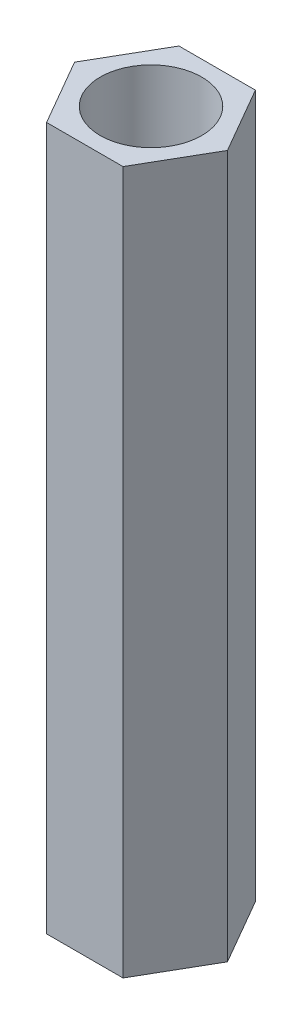
ISO-10303-21;
HEADER;
FILE_DESCRIPTION(('STEP AP214'),'2;1');
FILE_NAME('part.step','',(''),(''),'','','');
FILE_SCHEMA(('AUTOMOTIVE_DESIGN { 1 0 10303 214 1 1 1 1 }'));
ENDSEC;
DATA;
#1=APPLICATION_CONTEXT('core data for automotive mechanical design processes');
#2=APPLICATION_PROTOCOL_DEFINITION('international standard','automotive_design',2000,#1);
#3=PRODUCT_CONTEXT('',#1,'mechanical');
#4=PRODUCT('Part','Part','',(#3));
#5=PRODUCT_RELATED_PRODUCT_CATEGORY('part','',(#4));
#6=PRODUCT_DEFINITION_FORMATION('','',#4);
#7=PRODUCT_DEFINITION_CONTEXT('part definition',#1,'design');
#8=PRODUCT_DEFINITION('design','',#6,#7);
#9=PRODUCT_DEFINITION_SHAPE('','',#8);
#10=(LENGTH_UNIT() NAMED_UNIT(*) SI_UNIT(.MILLI.,.METRE.));
#11=(NAMED_UNIT(*) PLANE_ANGLE_UNIT() SI_UNIT($,.RADIAN.));
#12=(NAMED_UNIT(*) SI_UNIT($,.STERADIAN.) SOLID_ANGLE_UNIT());
#13=UNCERTAINTY_MEASURE_WITH_UNIT(LENGTH_MEASURE(1.E-05),#10,'distance_accuracy_value','');
#14=(GEOMETRIC_REPRESENTATION_CONTEXT(3) GLOBAL_UNCERTAINTY_ASSIGNED_CONTEXT((#13)) GLOBAL_UNIT_ASSIGNED_CONTEXT((#10,
#11,#12)) REPRESENTATION_CONTEXT('',''));
#15=CARTESIAN_POINT('',(0.,0.,0.));
#16=DIRECTION('',(0.,0.,1.));
#17=DIRECTION('',(1.,0.,0.));
#18=AXIS2_PLACEMENT_3D('',#15,#16,#17);
#19=CARTESIAN_POINT('',(0.,18.,0.));
#20=DIRECTION('',(0.,1.,0.));
#21=DIRECTION('',(0.,0.,1.));
#22=AXIS2_PLACEMENT_3D('',#19,#20,#21);
#23=PLANE('',#22);
#24=DIRECTION('',(1.,0.,0.));
#25=VECTOR('',#24,1.);
#26=CARTESIAN_POINT('',(-0.979018569486717,18.,1.6957099039044));
#27=LINE('',#26,#25);
#28=CARTESIAN_POINT('',(-0.979018569486717,18.,1.6957099039044));
#29=VERTEX_POINT('',#28);
#30=CARTESIAN_POINT('',(0.979018569486719,18.,1.6957099039044));
#31=VERTEX_POINT('',#30);
#32=EDGE_CURVE('E129',#29,#31,#27,.T.);
#33=ORIENTED_EDGE('',*,*,#32,.T.);
#34=DIRECTION('',(0.5,0.,-0.866025403784439));
#35=VECTOR('',#34,1.);
#36=CARTESIAN_POINT('',(0.979018569486719,18.,1.6957099039044));
#37=LINE('',#36,#35);
#38=CARTESIAN_POINT('',(1.95803713897344,18.,0.));
#39=VERTEX_POINT('',#38);
#40=EDGE_CURVE('E87',#31,#39,#37,.T.);
#41=ORIENTED_EDGE('',*,*,#40,.T.);
#42=DIRECTION('',(-0.5,0.,-0.866025403784438));
#43=VECTOR('',#42,1.);
#44=CARTESIAN_POINT('',(1.95803713897344,18.,0.));
#45=LINE('',#44,#43);
#46=CARTESIAN_POINT('',(0.979018569486718,18.,-1.6957099039044));
#47=VERTEX_POINT('',#46);
#48=EDGE_CURVE('E100',#39,#47,#45,.T.);
#49=ORIENTED_EDGE('',*,*,#48,.T.);
#50=DIRECTION('',(-1.,0.,0.));
#51=VECTOR('',#50,1.);
#52=CARTESIAN_POINT('',(0.979018569486718,18.,-1.6957099039044));
#53=LINE('',#52,#51);
#54=CARTESIAN_POINT('',(-0.979018569486718,18.,-1.6957099039044));
#55=VERTEX_POINT('',#54);
#56=EDGE_CURVE('E94',#47,#55,#53,.T.);
#57=ORIENTED_EDGE('',*,*,#56,.T.);
#58=DIRECTION('',(-0.5,0.,0.866025403784439));
#59=VECTOR('',#58,1.);
#60=CARTESIAN_POINT('',(-0.979018569486718,18.,-1.6957099039044));
#61=LINE('',#60,#59);
#62=CARTESIAN_POINT('',(-1.95803713897344,18.,0.));
#63=VERTEX_POINT('',#62);
#64=EDGE_CURVE('E98',#55,#63,#61,.T.);
#65=ORIENTED_EDGE('',*,*,#64,.T.);
#66=DIRECTION('',(0.5,0.,0.866025403784438));
#67=VECTOR('',#66,1.);
#68=CARTESIAN_POINT('',(-1.95803713897344,18.,0.));
#69=LINE('',#68,#67);
#70=EDGE_CURVE('E50',#63,#29,#69,.T.);
#71=ORIENTED_EDGE('',*,*,#70,.T.);
#72=EDGE_LOOP('',(#33,#41,#49,#57,#65,#71));
#73=FACE_BOUND('',#72,.T.);
#74=CARTESIAN_POINT('',(0.,18.,0.));
#75=DIRECTION('',(0.,1.,0.));
#76=DIRECTION('',(0.,0.,1.));
#77=AXIS2_PLACEMENT_3D('',#74,#75,#76);
#78=CIRCLE('',#77,1.3);
#79=CARTESIAN_POINT('',(0.,18.,1.3));
#80=VERTEX_POINT('',#79);
#81=EDGE_CURVE('E122',#80,#80,#78,.T.);
#82=ORIENTED_EDGE('',*,*,#81,.F.);
#83=EDGE_LOOP('',(#82));
#84=FACE_BOUND('',#83,.T.);
#85=ADVANCED_FACE('F33',(#73,#84),#23,.T.);
#86=CARTESIAN_POINT('',(0.,0.,0.));
#87=DIRECTION('',(0.,1.,0.));
#88=DIRECTION('',(0.,0.,1.));
#89=AXIS2_PLACEMENT_3D('',#86,#87,#88);
#90=PLANE('',#89);
#91=DIRECTION('',(1.,0.,0.));
#92=VECTOR('',#91,1.);
#93=CARTESIAN_POINT('',(-0.979018569486717,0.,1.6957099039044));
#94=LINE('',#93,#92);
#95=CARTESIAN_POINT('',(-0.979018569486717,0.,1.6957099039044));
#96=VERTEX_POINT('',#95);
#97=CARTESIAN_POINT('',(0.979018569486719,0.,1.6957099039044));
#98=VERTEX_POINT('',#97);
#99=EDGE_CURVE('E118',#96,#98,#94,.T.);
#100=ORIENTED_EDGE('',*,*,#99,.F.);
#101=DIRECTION('',(0.5,0.,0.866025403784438));
#102=VECTOR('',#101,1.);
#103=CARTESIAN_POINT('',(-1.95803713897344,0.,0.));
#104=LINE('',#103,#102);
#105=CARTESIAN_POINT('',(-1.95803713897344,0.,0.));
#106=VERTEX_POINT('',#105);
#107=EDGE_CURVE('E79',#106,#96,#104,.T.);
#108=ORIENTED_EDGE('',*,*,#107,.F.);
#109=DIRECTION('',(-0.5,0.,0.866025403784439));
#110=VECTOR('',#109,1.);
#111=CARTESIAN_POINT('',(-0.979018569486718,0.,-1.6957099039044));
#112=LINE('',#111,#110);
#113=CARTESIAN_POINT('',(-0.979018569486718,0.,-1.6957099039044));
#114=VERTEX_POINT('',#113);
#115=EDGE_CURVE('E73',#114,#106,#112,.T.);
#116=ORIENTED_EDGE('',*,*,#115,.F.);
#117=DIRECTION('',(-1.,0.,0.));
#118=VECTOR('',#117,1.);
#119=CARTESIAN_POINT('',(0.979018569486718,0.,-1.6957099039044));
#120=LINE('',#119,#118);
#121=CARTESIAN_POINT('',(0.979018569486718,0.,-1.6957099039044));
#122=VERTEX_POINT('',#121);
#123=EDGE_CURVE('E108',#122,#114,#120,.T.);
#124=ORIENTED_EDGE('',*,*,#123,.F.);
#125=DIRECTION('',(-0.5,0.,-0.866025403784438));
#126=VECTOR('',#125,1.);
#127=CARTESIAN_POINT('',(1.95803713897344,0.,0.));
#128=LINE('',#127,#126);
#129=CARTESIAN_POINT('',(1.95803713897344,0.,0.));
#130=VERTEX_POINT('',#129);
#131=EDGE_CURVE('E124',#130,#122,#128,.T.);
#132=ORIENTED_EDGE('',*,*,#131,.F.);
#133=DIRECTION('',(0.5,0.,-0.866025403784439));
#134=VECTOR('',#133,1.);
#135=CARTESIAN_POINT('',(0.979018569486719,0.,1.6957099039044));
#136=LINE('',#135,#134);
#137=EDGE_CURVE('E121',#98,#130,#136,.T.);
#138=ORIENTED_EDGE('',*,*,#137,.F.);
#139=EDGE_LOOP('',(#100,#108,#116,#124,#132,#138));
#140=FACE_BOUND('',#139,.T.);
#141=CARTESIAN_POINT('',(0.,0.,0.));
#142=DIRECTION('',(0.,1.,0.));
#143=DIRECTION('',(0.,0.,1.));
#144=AXIS2_PLACEMENT_3D('',#141,#142,#143);
#145=CIRCLE('',#144,1.3);
#146=CARTESIAN_POINT('',(0.,0.,1.3));
#147=VERTEX_POINT('',#146);
#148=EDGE_CURVE('E222',#147,#147,#145,.T.);
#149=ORIENTED_EDGE('',*,*,#148,.T.);
#150=EDGE_LOOP('',(#149));
#151=FACE_BOUND('',#150,.T.);
#152=ADVANCED_FACE('F138',(#140,#151),#90,.F.);
#153=CARTESIAN_POINT('',(-0.979018569486717,18.,1.6957099039044));
#154=DIRECTION('',(0.,0.,-1.));
#155=DIRECTION('',(-1.,0.,0.));
#156=AXIS2_PLACEMENT_3D('',#153,#154,#155);
#157=PLANE('',#156);
#158=ORIENTED_EDGE('',*,*,#99,.T.);
#159=DIRECTION('',(0.,-1.,0.));
#160=VECTOR('',#159,1.);
#161=CARTESIAN_POINT('',(0.979018569486719,18.,1.6957099039044));
#162=LINE('',#161,#160);
#163=EDGE_CURVE('E11',#31,#98,#162,.T.);
#164=ORIENTED_EDGE('',*,*,#163,.F.);
#165=ORIENTED_EDGE('',*,*,#32,.F.);
#166=DIRECTION('',(0.,-1.,0.));
#167=VECTOR('',#166,1.);
#168=CARTESIAN_POINT('',(-0.979018569486717,18.,1.6957099039044));
#169=LINE('',#168,#167);
#170=EDGE_CURVE('E114',#29,#96,#169,.T.);
#171=ORIENTED_EDGE('',*,*,#170,.T.);
#172=EDGE_LOOP('',(#158,#164,#165,#171));
#173=FACE_BOUND('',#172,.T.);
#174=ADVANCED_FACE('F35',(#173),#157,.F.);
#175=CARTESIAN_POINT('',(0.979018569486719,18.,1.6957099039044));
#176=DIRECTION('',(-0.866025403784439,0.,-0.5));
#177=DIRECTION('',(-0.5,0.,0.866025403784439));
#178=AXIS2_PLACEMENT_3D('',#175,#176,#177);
#179=PLANE('',#178);
#180=ORIENTED_EDGE('',*,*,#137,.T.);
#181=DIRECTION('',(0.,-1.,0.));
#182=VECTOR('',#181,1.);
#183=CARTESIAN_POINT('',(1.95803713897344,18.,0.));
#184=LINE('',#183,#182);
#185=EDGE_CURVE('E42',#39,#130,#184,.T.);
#186=ORIENTED_EDGE('',*,*,#185,.F.);
#187=ORIENTED_EDGE('',*,*,#40,.F.);
#188=ORIENTED_EDGE('',*,*,#163,.T.);
#189=EDGE_LOOP('',(#180,#186,#187,#188));
#190=FACE_BOUND('',#189,.T.);
#191=ADVANCED_FACE('F163',(#190),#179,.F.);
#192=CARTESIAN_POINT('',(1.95803713897344,18.,0.));
#193=DIRECTION('',(-0.866025403784438,0.,0.5));
#194=DIRECTION('',(0.5,0.,0.866025403784439));
#195=AXIS2_PLACEMENT_3D('',#192,#193,#194);
#196=PLANE('',#195);
#197=ORIENTED_EDGE('',*,*,#131,.T.);
#198=DIRECTION('',(0.,-1.,0.));
#199=VECTOR('',#198,1.);
#200=CARTESIAN_POINT('',(0.979018569486718,18.,-1.6957099039044));
#201=LINE('',#200,#199);
#202=EDGE_CURVE('E109',#47,#122,#201,.T.);
#203=ORIENTED_EDGE('',*,*,#202,.F.);
#204=ORIENTED_EDGE('',*,*,#48,.F.);
#205=ORIENTED_EDGE('',*,*,#185,.T.);
#206=EDGE_LOOP('',(#197,#203,#204,#205));
#207=FACE_BOUND('',#206,.T.);
#208=ADVANCED_FACE('F135',(#207),#196,.F.);
#209=CARTESIAN_POINT('',(0.979018569486718,18.,-1.6957099039044));
#210=DIRECTION('',(0.,0.,1.));
#211=DIRECTION('',(1.,0.,0.));
#212=AXIS2_PLACEMENT_3D('',#209,#210,#211);
#213=PLANE('',#212);
#214=ORIENTED_EDGE('',*,*,#123,.T.);
#215=DIRECTION('',(0.,-1.,0.));
#216=VECTOR('',#215,1.);
#217=CARTESIAN_POINT('',(-0.979018569486718,18.,-1.6957099039044));
#218=LINE('',#217,#216);
#219=EDGE_CURVE('E105',#55,#114,#218,.T.);
#220=ORIENTED_EDGE('',*,*,#219,.F.);
#221=ORIENTED_EDGE('',*,*,#56,.F.);
#222=ORIENTED_EDGE('',*,*,#202,.T.);
#223=EDGE_LOOP('',(#214,#220,#221,#222));
#224=FACE_BOUND('',#223,.T.);
#225=ADVANCED_FACE('F106',(#224),#213,.F.);
#226=CARTESIAN_POINT('',(-0.979018569486718,18.,-1.6957099039044));
#227=DIRECTION('',(0.866025403784439,0.,0.5));
#228=DIRECTION('',(0.5,0.,-0.866025403784439));
#229=AXIS2_PLACEMENT_3D('',#226,#227,#228);
#230=PLANE('',#229);
#231=ORIENTED_EDGE('',*,*,#115,.T.);
#232=DIRECTION('',(0.,-1.,0.));
#233=VECTOR('',#232,1.);
#234=CARTESIAN_POINT('',(-1.95803713897344,18.,0.));
#235=LINE('',#234,#233);
#236=EDGE_CURVE('E110',#63,#106,#235,.T.);
#237=ORIENTED_EDGE('',*,*,#236,.F.);
#238=ORIENTED_EDGE('',*,*,#64,.F.);
#239=ORIENTED_EDGE('',*,*,#219,.T.);
#240=EDGE_LOOP('',(#231,#237,#238,#239));
#241=FACE_BOUND('',#240,.T.);
#242=ADVANCED_FACE('F112',(#241),#230,.F.);
#243=CARTESIAN_POINT('',(-1.95803713897344,18.,0.));
#244=DIRECTION('',(0.866025403784438,0.,-0.5));
#245=DIRECTION('',(-0.5,0.,-0.866025403784438));
#246=AXIS2_PLACEMENT_3D('',#243,#244,#245);
#247=PLANE('',#246);
#248=ORIENTED_EDGE('',*,*,#107,.T.);
#249=ORIENTED_EDGE('',*,*,#170,.F.);
#250=ORIENTED_EDGE('',*,*,#70,.F.);
#251=ORIENTED_EDGE('',*,*,#236,.T.);
#252=EDGE_LOOP('',(#248,#249,#250,#251));
#253=FACE_BOUND('',#252,.T.);
#254=ADVANCED_FACE('F143',(#253),#247,.F.);
#255=CARTESIAN_POINT('',(0.,18.,0.));
#256=DIRECTION('',(0.,-1.,0.));
#257=DIRECTION('',(0.,0.,-1.));
#258=AXIS2_PLACEMENT_3D('',#255,#256,#257);
#259=CYLINDRICAL_SURFACE('',#258,1.3);
#260=ORIENTED_EDGE('',*,*,#81,.T.);
#261=EDGE_LOOP('',(#260));
#262=FACE_BOUND('',#261,.T.);
#263=ORIENTED_EDGE('',*,*,#148,.F.);
#264=EDGE_LOOP('',(#263));
#265=FACE_BOUND('',#264,.T.);
#266=ADVANCED_FACE('F145',(#262,#265),#259,.F.);
#267=CLOSED_SHELL('',(#85,#152,#174,#191,#208,#225,#242,#254,#266));
#268=MANIFOLD_SOLID_BREP('B2',#267);
#269=ADVANCED_BREP_SHAPE_REPRESENTATION('',(#18,#268),#14);
#270=SHAPE_DEFINITION_REPRESENTATION(#9,#269);
ENDSEC;
END-ISO-10303-21;
